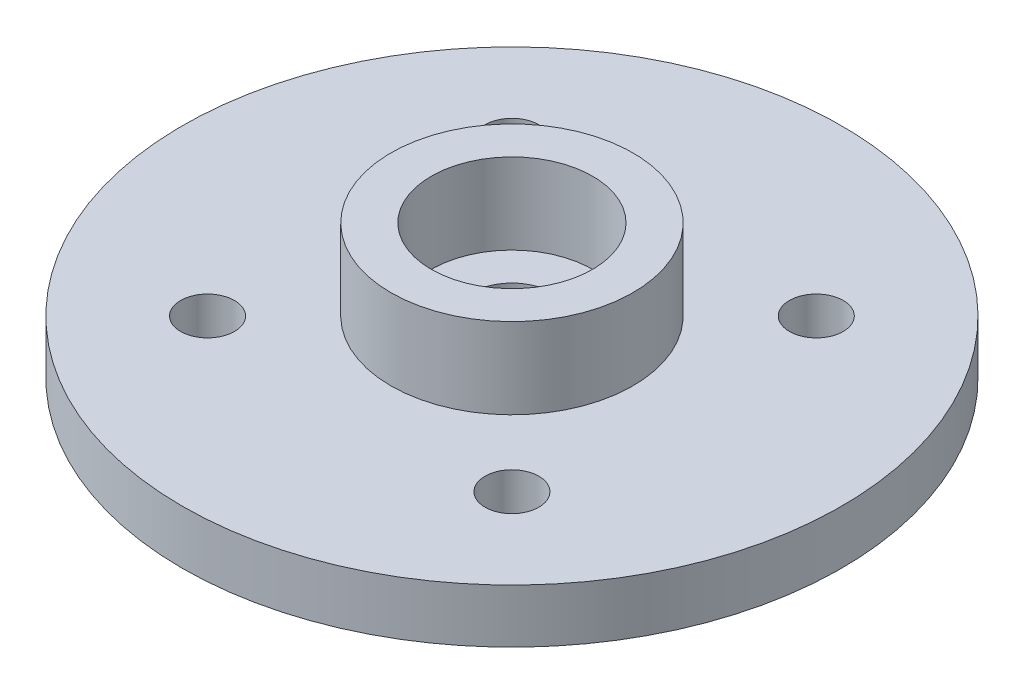
ISO-10303-21;
HEADER;
FILE_DESCRIPTION(('STEP AP214'),'2;1');
FILE_NAME('part.step','',(''),(''),'','','');
FILE_SCHEMA(('AUTOMOTIVE_DESIGN { 1 0 10303 214 1 1 1 1 }'));
ENDSEC;
DATA;
#1=APPLICATION_CONTEXT('core data for automotive mechanical design processes');
#2=APPLICATION_PROTOCOL_DEFINITION('international standard','automotive_design',2000,#1);
#3=PRODUCT_CONTEXT('',#1,'mechanical');
#4=PRODUCT('Part','Part','',(#3));
#5=PRODUCT_RELATED_PRODUCT_CATEGORY('part','',(#4));
#6=PRODUCT_DEFINITION_FORMATION('','',#4);
#7=PRODUCT_DEFINITION_CONTEXT('part definition',#1,'design');
#8=PRODUCT_DEFINITION('design','',#6,#7);
#9=PRODUCT_DEFINITION_SHAPE('','',#8);
#10=(LENGTH_UNIT() NAMED_UNIT(*) SI_UNIT(.MILLI.,.METRE.));
#11=(NAMED_UNIT(*) PLANE_ANGLE_UNIT() SI_UNIT($,.RADIAN.));
#12=(NAMED_UNIT(*) SI_UNIT($,.STERADIAN.) SOLID_ANGLE_UNIT());
#13=UNCERTAINTY_MEASURE_WITH_UNIT(LENGTH_MEASURE(1.E-05),#10,'distance_accuracy_value','');
#14=(GEOMETRIC_REPRESENTATION_CONTEXT(3) GLOBAL_UNCERTAINTY_ASSIGNED_CONTEXT((#13)) GLOBAL_UNIT_ASSIGNED_CONTEXT((#10,
#11,#12)) REPRESENTATION_CONTEXT('',''));
#15=CARTESIAN_POINT('',(0.,0.,0.));
#16=DIRECTION('',(0.,0.,1.));
#17=DIRECTION('',(1.,0.,0.));
#18=AXIS2_PLACEMENT_3D('',#15,#16,#17);
#19=CARTESIAN_POINT('',(0.,2.,0.));
#20=DIRECTION('',(0.,1.,0.));
#21=DIRECTION('',(0.,0.,1.));
#22=AXIS2_PLACEMENT_3D('',#19,#20,#21);
#23=PLANE('',#22);
#24=CARTESIAN_POINT('',(0.,2.,0.));
#25=DIRECTION('',(0.,1.,0.));
#26=DIRECTION('',(0.,0.,1.));
#27=AXIS2_PLACEMENT_3D('',#24,#25,#26);
#28=CIRCLE('',#27,1.5);
#29=CARTESIAN_POINT('',(0.,2.,1.5));
#30=VERTEX_POINT('',#29);
#31=EDGE_CURVE('E86',#30,#30,#28,.T.);
#32=ORIENTED_EDGE('',*,*,#31,.F.);
#33=EDGE_LOOP('',(#32));
#34=FACE_BOUND('',#33,.T.);
#35=CARTESIAN_POINT('',(0.,2.,0.));
#36=DIRECTION('',(0.,1.,0.));
#37=DIRECTION('',(0.,0.,1.));
#38=AXIS2_PLACEMENT_3D('',#35,#36,#37);
#39=CIRCLE('',#38,3.);
#40=CARTESIAN_POINT('',(0.,2.,3.));
#41=VERTEX_POINT('',#40);
#42=EDGE_CURVE('E10',#41,#41,#39,.F.);
#43=ORIENTED_EDGE('',*,*,#42,.F.);
#44=EDGE_LOOP('',(#43));
#45=FACE_BOUND('',#44,.T.);
#46=ADVANCED_FACE('F37',(#34,#45),#23,.T.);
#47=CARTESIAN_POINT('',(0.,2.,0.));
#48=DIRECTION('',(0.,1.,0.));
#49=DIRECTION('',(0.,0.,1.));
#50=AXIS2_PLACEMENT_3D('',#47,#48,#49);
#51=CIRCLE('',#50,4.5);
#52=CARTESIAN_POINT('',(0.,2.,4.5));
#53=VERTEX_POINT('',#52);
#54=EDGE_CURVE('E98',#53,#53,#51,.T.);
#55=ORIENTED_EDGE('',*,*,#54,.F.);
#56=EDGE_LOOP('',(#55));
#57=FACE_BOUND('',#56,.T.);
#58=CARTESIAN_POINT('',(5.65685424949238,2.,5.65685424949238));
#59=DIRECTION('',(0.,1.,0.));
#60=DIRECTION('',(0.,0.,1.));
#61=AXIS2_PLACEMENT_3D('',#58,#59,#60);
#62=CIRCLE('',#61,1.);
#63=CARTESIAN_POINT('',(5.65685424949238,2.,6.65685424949238));
#64=VERTEX_POINT('',#63);
#65=EDGE_CURVE('E78',#64,#64,#62,.T.);
#66=ORIENTED_EDGE('',*,*,#65,.F.);
#67=EDGE_LOOP('',(#66));
#68=FACE_BOUND('',#67,.T.);
#69=CARTESIAN_POINT('',(5.65685424949238,2.,-5.65685424949238));
#70=DIRECTION('',(0.,1.,0.));
#71=DIRECTION('',(0.,0.,1.));
#72=AXIS2_PLACEMENT_3D('',#69,#70,#71);
#73=CIRCLE('',#72,1.);
#74=CARTESIAN_POINT('',(5.65685424949238,2.,-4.65685424949238));
#75=VERTEX_POINT('',#74);
#76=EDGE_CURVE('E62',#75,#75,#73,.T.);
#77=ORIENTED_EDGE('',*,*,#76,.F.);
#78=EDGE_LOOP('',(#77));
#79=FACE_BOUND('',#78,.T.);
#80=CARTESIAN_POINT('',(0.,2.,0.));
#81=DIRECTION('',(0.,1.,0.));
#82=DIRECTION('',(0.,0.,1.));
#83=AXIS2_PLACEMENT_3D('',#80,#81,#82);
#84=CIRCLE('',#83,12.25);
#85=CARTESIAN_POINT('',(0.,2.,12.25));
#86=VERTEX_POINT('',#85);
#87=EDGE_CURVE('E45',#86,#86,#84,.T.);
#88=ORIENTED_EDGE('',*,*,#87,.T.);
#89=EDGE_LOOP('',(#88));
#90=FACE_BOUND('',#89,.T.);
#91=CARTESIAN_POINT('',(-5.65685424949238,2.,-5.65685424949238));
#92=DIRECTION('',(0.,1.,0.));
#93=DIRECTION('',(0.,0.,1.));
#94=AXIS2_PLACEMENT_3D('',#91,#92,#93);
#95=CIRCLE('',#94,1.);
#96=CARTESIAN_POINT('',(-5.65685424949238,2.,-4.65685424949238));
#97=VERTEX_POINT('',#96);
#98=EDGE_CURVE('E56',#97,#97,#95,.T.);
#99=ORIENTED_EDGE('',*,*,#98,.F.);
#100=EDGE_LOOP('',(#99));
#101=FACE_BOUND('',#100,.T.);
#102=CARTESIAN_POINT('',(-5.65685424949238,2.,5.65685424949238));
#103=DIRECTION('',(0.,1.,0.));
#104=DIRECTION('',(0.,0.,1.));
#105=AXIS2_PLACEMENT_3D('',#102,#103,#104);
#106=CIRCLE('',#105,1.);
#107=CARTESIAN_POINT('',(-5.65685424949238,2.,6.65685424949238));
#108=VERTEX_POINT('',#107);
#109=EDGE_CURVE('E70',#108,#108,#106,.T.);
#110=ORIENTED_EDGE('',*,*,#109,.F.);
#111=EDGE_LOOP('',(#110));
#112=FACE_BOUND('',#111,.T.);
#113=ADVANCED_FACE('F129',(#57,#68,#79,#90,#101,#112),#23,.T.);
#114=CARTESIAN_POINT('',(0.,0.,0.));
#115=DIRECTION('',(0.,1.,0.));
#116=DIRECTION('',(0.,0.,1.));
#117=AXIS2_PLACEMENT_3D('',#114,#115,#116);
#118=PLANE('',#117);
#119=CARTESIAN_POINT('',(0.,0.,0.));
#120=DIRECTION('',(0.,1.,0.));
#121=DIRECTION('',(0.,0.,1.));
#122=AXIS2_PLACEMENT_3D('',#119,#120,#121);
#123=CIRCLE('',#122,12.25);
#124=CARTESIAN_POINT('',(0.,0.,12.25));
#125=VERTEX_POINT('',#124);
#126=EDGE_CURVE('E50',#125,#125,#123,.T.);
#127=ORIENTED_EDGE('',*,*,#126,.F.);
#128=EDGE_LOOP('',(#127));
#129=FACE_BOUND('',#128,.T.);
#130=CARTESIAN_POINT('',(-5.65685424949238,0.,-5.65685424949238));
#131=DIRECTION('',(0.,1.,0.));
#132=DIRECTION('',(0.,0.,1.));
#133=AXIS2_PLACEMENT_3D('',#130,#131,#132);
#134=CIRCLE('',#133,1.);
#135=CARTESIAN_POINT('',(-5.65685424949238,0.,-4.65685424949238));
#136=VERTEX_POINT('',#135);
#137=EDGE_CURVE('E58',#136,#136,#134,.T.);
#138=ORIENTED_EDGE('',*,*,#137,.T.);
#139=EDGE_LOOP('',(#138));
#140=FACE_BOUND('',#139,.T.);
#141=CARTESIAN_POINT('',(5.65685424949238,0.,-5.65685424949238));
#142=DIRECTION('',(0.,1.,0.));
#143=DIRECTION('',(0.,0.,1.));
#144=AXIS2_PLACEMENT_3D('',#141,#142,#143);
#145=CIRCLE('',#144,1.);
#146=CARTESIAN_POINT('',(5.65685424949238,0.,-4.65685424949238));
#147=VERTEX_POINT('',#146);
#148=EDGE_CURVE('E66',#147,#147,#145,.T.);
#149=ORIENTED_EDGE('',*,*,#148,.T.);
#150=EDGE_LOOP('',(#149));
#151=FACE_BOUND('',#150,.T.);
#152=CARTESIAN_POINT('',(-5.65685424949238,0.,5.65685424949238));
#153=DIRECTION('',(0.,1.,0.));
#154=DIRECTION('',(0.,0.,1.));
#155=AXIS2_PLACEMENT_3D('',#152,#153,#154);
#156=CIRCLE('',#155,1.);
#157=CARTESIAN_POINT('',(-5.65685424949238,0.,6.65685424949238));
#158=VERTEX_POINT('',#157);
#159=EDGE_CURVE('E74',#158,#158,#156,.T.);
#160=ORIENTED_EDGE('',*,*,#159,.T.);
#161=EDGE_LOOP('',(#160));
#162=FACE_BOUND('',#161,.T.);
#163=CARTESIAN_POINT('',(5.65685424949238,0.,5.65685424949238));
#164=DIRECTION('',(0.,1.,0.));
#165=DIRECTION('',(0.,0.,1.));
#166=AXIS2_PLACEMENT_3D('',#163,#164,#165);
#167=CIRCLE('',#166,1.);
#168=CARTESIAN_POINT('',(5.65685424949238,0.,6.65685424949238));
#169=VERTEX_POINT('',#168);
#170=EDGE_CURVE('E82',#169,#169,#167,.T.);
#171=ORIENTED_EDGE('',*,*,#170,.T.);
#172=EDGE_LOOP('',(#171));
#173=FACE_BOUND('',#172,.T.);
#174=CARTESIAN_POINT('',(0.,0.,0.));
#175=DIRECTION('',(0.,1.,0.));
#176=DIRECTION('',(0.,0.,1.));
#177=AXIS2_PLACEMENT_3D('',#174,#175,#176);
#178=CIRCLE('',#177,1.5);
#179=CARTESIAN_POINT('',(0.,0.,1.5));
#180=VERTEX_POINT('',#179);
#181=EDGE_CURVE('E90',#180,#180,#178,.T.);
#182=ORIENTED_EDGE('',*,*,#181,.T.);
#183=EDGE_LOOP('',(#182));
#184=FACE_BOUND('',#183,.T.);
#185=ADVANCED_FACE('F135',(#129,#140,#151,#162,#173,#184),#118,.F.);
#186=CARTESIAN_POINT('',(0.,2.,0.));
#187=DIRECTION('',(0.,-1.,0.));
#188=DIRECTION('',(0.,0.,-1.));
#189=AXIS2_PLACEMENT_3D('',#186,#187,#188);
#190=CYLINDRICAL_SURFACE('',#189,12.25);
#191=ORIENTED_EDGE('',*,*,#87,.F.);
#192=EDGE_LOOP('',(#191));
#193=FACE_BOUND('',#192,.T.);
#194=ORIENTED_EDGE('',*,*,#126,.T.);
#195=EDGE_LOOP('',(#194));
#196=FACE_BOUND('',#195,.T.);
#197=ADVANCED_FACE('F39',(#193,#196),#190,.T.);
#198=CARTESIAN_POINT('',(-5.65685424949238,2.,-5.65685424949238));
#199=DIRECTION('',(0.,-1.,0.));
#200=DIRECTION('',(0.,0.,-1.));
#201=AXIS2_PLACEMENT_3D('',#198,#199,#200);
#202=CYLINDRICAL_SURFACE('',#201,1.);
#203=ORIENTED_EDGE('',*,*,#98,.T.);
#204=EDGE_LOOP('',(#203));
#205=FACE_BOUND('',#204,.T.);
#206=ORIENTED_EDGE('',*,*,#137,.F.);
#207=EDGE_LOOP('',(#206));
#208=FACE_BOUND('',#207,.T.);
#209=ADVANCED_FACE('F140',(#205,#208),#202,.F.);
#210=CARTESIAN_POINT('',(5.65685424949238,2.,-5.65685424949238));
#211=DIRECTION('',(0.,-1.,0.));
#212=DIRECTION('',(0.,0.,-1.));
#213=AXIS2_PLACEMENT_3D('',#210,#211,#212);
#214=CYLINDRICAL_SURFACE('',#213,1.);
#215=ORIENTED_EDGE('',*,*,#76,.T.);
#216=EDGE_LOOP('',(#215));
#217=FACE_BOUND('',#216,.T.);
#218=ORIENTED_EDGE('',*,*,#148,.F.);
#219=EDGE_LOOP('',(#218));
#220=FACE_BOUND('',#219,.T.);
#221=ADVANCED_FACE('F168',(#217,#220),#214,.F.);
#222=CARTESIAN_POINT('',(-5.65685424949238,2.,5.65685424949238));
#223=DIRECTION('',(0.,-1.,0.));
#224=DIRECTION('',(0.,0.,-1.));
#225=AXIS2_PLACEMENT_3D('',#222,#223,#224);
#226=CYLINDRICAL_SURFACE('',#225,1.);
#227=ORIENTED_EDGE('',*,*,#109,.T.);
#228=EDGE_LOOP('',(#227));
#229=FACE_BOUND('',#228,.T.);
#230=ORIENTED_EDGE('',*,*,#159,.F.);
#231=EDGE_LOOP('',(#230));
#232=FACE_BOUND('',#231,.T.);
#233=ADVANCED_FACE('F162',(#229,#232),#226,.F.);
#234=CARTESIAN_POINT('',(5.65685424949238,2.,5.65685424949238));
#235=DIRECTION('',(0.,-1.,0.));
#236=DIRECTION('',(0.,0.,-1.));
#237=AXIS2_PLACEMENT_3D('',#234,#235,#236);
#238=CYLINDRICAL_SURFACE('',#237,1.);
#239=ORIENTED_EDGE('',*,*,#65,.T.);
#240=EDGE_LOOP('',(#239));
#241=FACE_BOUND('',#240,.T.);
#242=ORIENTED_EDGE('',*,*,#170,.F.);
#243=EDGE_LOOP('',(#242));
#244=FACE_BOUND('',#243,.T.);
#245=ADVANCED_FACE('F124',(#241,#244),#238,.F.);
#246=CARTESIAN_POINT('',(0.,2.,0.));
#247=DIRECTION('',(0.,-1.,0.));
#248=DIRECTION('',(0.,0.,-1.));
#249=AXIS2_PLACEMENT_3D('',#246,#247,#248);
#250=CYLINDRICAL_SURFACE('',#249,1.5);
#251=ORIENTED_EDGE('',*,*,#31,.T.);
#252=EDGE_LOOP('',(#251));
#253=FACE_BOUND('',#252,.T.);
#254=ORIENTED_EDGE('',*,*,#181,.F.);
#255=EDGE_LOOP('',(#254));
#256=FACE_BOUND('',#255,.T.);
#257=ADVANCED_FACE('F115',(#253,#256),#250,.F.);
#258=CARTESIAN_POINT('',(0.,5.,0.));
#259=DIRECTION('',(0.,1.,0.));
#260=DIRECTION('',(0.,0.,1.));
#261=AXIS2_PLACEMENT_3D('',#258,#259,#260);
#262=PLANE('',#261);
#263=CARTESIAN_POINT('',(0.,5.,0.));
#264=DIRECTION('',(0.,1.,0.));
#265=DIRECTION('',(0.,0.,1.));
#266=AXIS2_PLACEMENT_3D('',#263,#264,#265);
#267=CIRCLE('',#266,4.5);
#268=CARTESIAN_POINT('',(0.,5.,4.5));
#269=VERTEX_POINT('',#268);
#270=EDGE_CURVE('E94',#269,#269,#267,.T.);
#271=ORIENTED_EDGE('',*,*,#270,.T.);
#272=EDGE_LOOP('',(#271));
#273=FACE_BOUND('',#272,.T.);
#274=CARTESIAN_POINT('',(0.,5.,0.));
#275=DIRECTION('',(0.,1.,0.));
#276=DIRECTION('',(0.,0.,1.));
#277=AXIS2_PLACEMENT_3D('',#274,#275,#276);
#278=CIRCLE('',#277,3.);
#279=CARTESIAN_POINT('',(0.,5.,3.));
#280=VERTEX_POINT('',#279);
#281=EDGE_CURVE('E102',#280,#280,#278,.T.);
#282=ORIENTED_EDGE('',*,*,#281,.F.);
#283=EDGE_LOOP('',(#282));
#284=FACE_BOUND('',#283,.T.);
#285=ADVANCED_FACE('F112',(#273,#284),#262,.T.);
#286=CARTESIAN_POINT('',(0.,5.,0.));
#287=DIRECTION('',(0.,-1.,0.));
#288=DIRECTION('',(0.,0.,-1.));
#289=AXIS2_PLACEMENT_3D('',#286,#287,#288);
#290=CYLINDRICAL_SURFACE('',#289,4.5);
#291=ORIENTED_EDGE('',*,*,#270,.F.);
#292=EDGE_LOOP('',(#291));
#293=FACE_BOUND('',#292,.T.);
#294=ORIENTED_EDGE('',*,*,#54,.T.);
#295=EDGE_LOOP('',(#294));
#296=FACE_BOUND('',#295,.T.);
#297=ADVANCED_FACE('F114',(#293,#296),#290,.T.);
#298=CARTESIAN_POINT('',(0.,5.,0.));
#299=DIRECTION('',(0.,-1.,0.));
#300=DIRECTION('',(0.,0.,-1.));
#301=AXIS2_PLACEMENT_3D('',#298,#299,#300);
#302=CYLINDRICAL_SURFACE('',#301,3.);
#303=ORIENTED_EDGE('',*,*,#281,.T.);
#304=EDGE_LOOP('',(#303));
#305=FACE_BOUND('',#304,.T.);
#306=ORIENTED_EDGE('',*,*,#42,.T.);
#307=EDGE_LOOP('',(#306));
#308=FACE_BOUND('',#307,.T.);
#309=ADVANCED_FACE('F110',(#305,#308),#302,.F.);
#310=CLOSED_SHELL('',(#46,#113,#185,#197,#209,#221,#233,#245,#257,#285,#297,#309));
#311=MANIFOLD_SOLID_BREP('B2',#310);
#312=ADVANCED_BREP_SHAPE_REPRESENTATION('',(#18,#311),#14);
#313=SHAPE_DEFINITION_REPRESENTATION(#9,#312);
ENDSEC;
END-ISO-10303-21;
